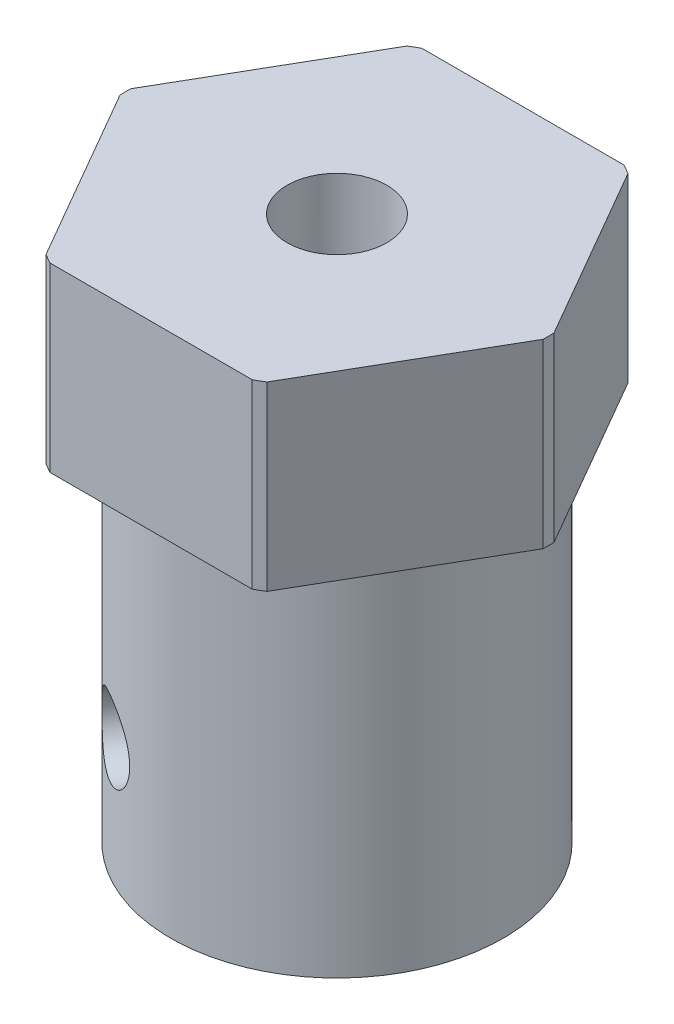
ISO-10303-21;
HEADER;
FILE_DESCRIPTION(('STEP AP214'),'2;1');
FILE_NAME('part.step','',(''),(''),'','','');
FILE_SCHEMA(('AUTOMOTIVE_DESIGN { 1 0 10303 214 1 1 1 1 }'));
ENDSEC;
DATA;
#1=APPLICATION_CONTEXT('core data for automotive mechanical design processes');
#2=APPLICATION_PROTOCOL_DEFINITION('international standard','automotive_design',2000,#1);
#3=PRODUCT_CONTEXT('',#1,'mechanical');
#4=PRODUCT('Part','Part','',(#3));
#5=PRODUCT_RELATED_PRODUCT_CATEGORY('part','',(#4));
#6=PRODUCT_DEFINITION_FORMATION('','',#4);
#7=PRODUCT_DEFINITION_CONTEXT('part definition',#1,'design');
#8=PRODUCT_DEFINITION('design','',#6,#7);
#9=PRODUCT_DEFINITION_SHAPE('','',#8);
#10=(LENGTH_UNIT() NAMED_UNIT(*) SI_UNIT(.MILLI.,.METRE.));
#11=(NAMED_UNIT(*) PLANE_ANGLE_UNIT() SI_UNIT($,.RADIAN.));
#12=(NAMED_UNIT(*) SI_UNIT($,.STERADIAN.) SOLID_ANGLE_UNIT());
#13=UNCERTAINTY_MEASURE_WITH_UNIT(LENGTH_MEASURE(1.E-05),#10,'distance_accuracy_value','');
#14=(GEOMETRIC_REPRESENTATION_CONTEXT(3) GLOBAL_UNCERTAINTY_ASSIGNED_CONTEXT((#13)) GLOBAL_UNIT_ASSIGNED_CONTEXT((#10,
#11,#12)) REPRESENTATION_CONTEXT('',''));
#15=CARTESIAN_POINT('',(0.,0.,0.));
#16=DIRECTION('',(0.,0.,1.));
#17=DIRECTION('',(1.,0.,0.));
#18=AXIS2_PLACEMENT_3D('',#15,#16,#17);
#19=CARTESIAN_POINT('',(0.,18.,0.));
#20=DIRECTION('',(0.,1.,0.));
#21=DIRECTION('',(0.,0.,1.));
#22=AXIS2_PLACEMENT_3D('',#19,#20,#21);
#23=CYLINDRICAL_SURFACE('',#22,1.64999999999999);
#24=CARTESIAN_POINT('',(0.,18.,0.));
#25=DIRECTION('',(0.,1.,0.));
#26=DIRECTION('',(0.,0.,1.));
#27=AXIS2_PLACEMENT_3D('',#24,#25,#26);
#28=CIRCLE('',#27,1.64999999999999);
#29=CARTESIAN_POINT('',(0.,18.,1.64999999999999));
#30=VERTEX_POINT('',#29);
#31=EDGE_CURVE('E185',#30,#30,#28,.T.);
#32=ORIENTED_EDGE('',*,*,#31,.T.);
#33=EDGE_LOOP('',(#32));
#34=FACE_BOUND('',#33,.T.);
#35=CARTESIAN_POINT('',(0.,14.,0.));
#36=DIRECTION('',(0.,-1.,0.));
#37=DIRECTION('',(0.,0.,-1.));
#38=AXIS2_PLACEMENT_3D('',#35,#36,#37);
#39=CIRCLE('',#38,1.64999999999999);
#40=CARTESIAN_POINT('',(0.,14.,-1.64999999999999));
#41=VERTEX_POINT('',#40);
#42=EDGE_CURVE('E183',#41,#41,#39,.F.);
#43=ORIENTED_EDGE('',*,*,#42,.F.);
#44=EDGE_LOOP('',(#43));
#45=FACE_BOUND('',#44,.T.);
#46=ADVANCED_FACE('F38',(#34,#45),#23,.F.);
#47=CARTESIAN_POINT('',(0.,18.,0.));
#48=DIRECTION('',(0.,1.,0.));
#49=DIRECTION('',(0.,0.,1.));
#50=AXIS2_PLACEMENT_3D('',#47,#48,#49);
#51=PLANE('',#50);
#52=ORIENTED_EDGE('',*,*,#31,.F.);
#53=EDGE_LOOP('',(#52));
#54=FACE_BOUND('',#53,.T.);
#55=CARTESIAN_POINT('',(0.,18.,0.));
#56=DIRECTION('',(0.,-1.,0.));
#57=DIRECTION('',(0.,0.,-1.));
#58=AXIS2_PLACEMENT_3D('',#55,#56,#57);
#59=CIRCLE('',#58,7.);
#60=CARTESIAN_POINT('',(3.65441781543388,18.,5.97036267158365));
#61=VERTEX_POINT('',#60);
#62=CARTESIAN_POINT('',(3.34327683568083,18.,6.15));
#63=VERTEX_POINT('',#62);
#64=EDGE_CURVE('E160',#61,#63,#59,.T.);
#65=ORIENTED_EDGE('',*,*,#64,.F.);
#66=DIRECTION('',(0.5,0.,-0.866025403784438));
#67=VECTOR('',#66,1.);
#68=CARTESIAN_POINT('',(3.5507041555162,18.,6.15));
#69=LINE('',#68,#67);
#70=CARTESIAN_POINT('',(6.99769465111471,18.,0.17963732841635));
#71=VERTEX_POINT('',#70);
#72=EDGE_CURVE('E144',#61,#71,#69,.T.);
#73=ORIENTED_EDGE('',*,*,#72,.T.);
#74=CARTESIAN_POINT('',(6.99769465111471,18.,-0.179637328416352));
#75=VERTEX_POINT('',#74);
#76=EDGE_CURVE('E151',#75,#71,#59,.T.);
#77=ORIENTED_EDGE('',*,*,#76,.F.);
#78=DIRECTION('',(-0.5,0.,-0.866025403784438));
#79=VECTOR('',#78,1.);
#80=CARTESIAN_POINT('',(7.1014083110324,18.,0.));
#81=LINE('',#80,#79);
#82=CARTESIAN_POINT('',(3.65441781543388,18.,-5.97036267158365));
#83=VERTEX_POINT('',#82);
#84=EDGE_CURVE('E132',#75,#83,#81,.T.);
#85=ORIENTED_EDGE('',*,*,#84,.T.);
#86=CARTESIAN_POINT('',(3.34327683568083,18.,-6.15));
#87=VERTEX_POINT('',#86);
#88=EDGE_CURVE('E159',#87,#83,#59,.T.);
#89=ORIENTED_EDGE('',*,*,#88,.F.);
#90=DIRECTION('',(-1.,0.,0.));
#91=VECTOR('',#90,1.);
#92=CARTESIAN_POINT('',(3.5507041555162,18.,-6.15));
#93=LINE('',#92,#91);
#94=CARTESIAN_POINT('',(-3.34327683568083,18.,-6.15));
#95=VERTEX_POINT('',#94);
#96=EDGE_CURVE('E143',#87,#95,#93,.T.);
#97=ORIENTED_EDGE('',*,*,#96,.T.);
#98=CARTESIAN_POINT('',(-3.65441781543388,18.,-5.97036267158365));
#99=VERTEX_POINT('',#98);
#100=EDGE_CURVE('E163',#99,#95,#59,.T.);
#101=ORIENTED_EDGE('',*,*,#100,.F.);
#102=DIRECTION('',(-0.5,0.,0.866025403784439));
#103=VECTOR('',#102,1.);
#104=CARTESIAN_POINT('',(-3.5507041555162,18.,-6.15));
#105=LINE('',#104,#103);
#106=CARTESIAN_POINT('',(-6.99769465111471,18.,-0.179637328416349));
#107=VERTEX_POINT('',#106);
#108=EDGE_CURVE('E302',#99,#107,#105,.T.);
#109=ORIENTED_EDGE('',*,*,#108,.T.);
#110=CARTESIAN_POINT('',(-6.99769465111471,18.,0.17963732841635));
#111=VERTEX_POINT('',#110);
#112=EDGE_CURVE('E485',#111,#107,#59,.T.);
#113=ORIENTED_EDGE('',*,*,#112,.F.);
#114=DIRECTION('',(0.5,0.,0.866025403784438));
#115=VECTOR('',#114,1.);
#116=CARTESIAN_POINT('',(-7.1014083110324,18.,0.));
#117=LINE('',#116,#115);
#118=CARTESIAN_POINT('',(-3.65441781543388,18.,5.97036267158365));
#119=VERTEX_POINT('',#118);
#120=EDGE_CURVE('E299',#111,#119,#117,.T.);
#121=ORIENTED_EDGE('',*,*,#120,.T.);
#122=CARTESIAN_POINT('',(-3.34327683568083,18.,6.15));
#123=VERTEX_POINT('',#122);
#124=EDGE_CURVE('E165',#123,#119,#59,.T.);
#125=ORIENTED_EDGE('',*,*,#124,.F.);
#126=DIRECTION('',(1.,0.,0.));
#127=VECTOR('',#126,1.);
#128=CARTESIAN_POINT('',(-3.5507041555162,18.,6.15));
#129=LINE('',#128,#127);
#130=EDGE_CURVE('E296',#123,#63,#129,.T.);
#131=ORIENTED_EDGE('',*,*,#130,.T.);
#132=EDGE_LOOP('',(#65,#73,#77,#85,#89,#97,#101,#109,#113,#121,#125,#131));
#133=FACE_BOUND('',#132,.T.);
#134=ADVANCED_FACE('F158',(#54,#133),#51,.T.);
#135=CARTESIAN_POINT('',(0.,0.,0.));
#136=DIRECTION('',(0.,-1.,0.));
#137=DIRECTION('',(0.,0.,-1.));
#138=AXIS2_PLACEMENT_3D('',#135,#136,#137);
#139=CYLINDRICAL_SURFACE('',#138,7.);
#140=CARTESIAN_POINT('',(0.,12.,0.));
#141=DIRECTION('',(0.,-1.,0.));
#142=DIRECTION('',(0.,0.,-1.));
#143=AXIS2_PLACEMENT_3D('',#140,#141,#142);
#144=CIRCLE('',#143,7.);
#145=CARTESIAN_POINT('',(3.65441781543388,12.,5.97036267158366));
#146=VERTEX_POINT('',#145);
#147=CARTESIAN_POINT('',(3.34327683568083,12.,6.15));
#148=VERTEX_POINT('',#147);
#149=EDGE_CURVE('E258',#146,#148,#144,.T.);
#150=ORIENTED_EDGE('',*,*,#149,.F.);
#151=DIRECTION('',(0.,-1.,0.));
#152=VECTOR('',#151,1.);
#153=CARTESIAN_POINT('',(3.65441781543388,0.,5.97036267158365));
#154=LINE('',#153,#152);
#155=EDGE_CURVE('E250',#146,#61,#154,.F.);
#156=ORIENTED_EDGE('',*,*,#155,.T.);
#157=ORIENTED_EDGE('',*,*,#64,.T.);
#158=DIRECTION('',(0.,-1.,0.));
#159=VECTOR('',#158,1.);
#160=CARTESIAN_POINT('',(3.34327683568083,0.,6.15));
#161=LINE('',#160,#159);
#162=EDGE_CURVE('E279',#63,#148,#161,.T.);
#163=ORIENTED_EDGE('',*,*,#162,.T.);
#164=EDGE_LOOP('',(#150,#156,#157,#163));
#165=FACE_BOUND('',#164,.T.);
#166=ADVANCED_FACE('F386',(#165),#139,.T.);
#167=ORIENTED_EDGE('',*,*,#76,.T.);
#168=DIRECTION('',(0.,-1.,0.));
#169=VECTOR('',#168,1.);
#170=CARTESIAN_POINT('',(6.99769465111471,0.,0.17963732841635));
#171=LINE('',#170,#169);
#172=CARTESIAN_POINT('',(6.99769465111471,12.,0.179637328416346));
#173=VERTEX_POINT('',#172);
#174=EDGE_CURVE('E248',#71,#173,#171,.T.);
#175=ORIENTED_EDGE('',*,*,#174,.T.);
#176=CARTESIAN_POINT('',(6.99769465111471,12.,-0.179637328416353));
#177=VERTEX_POINT('',#176);
#178=EDGE_CURVE('E153',#177,#173,#144,.T.);
#179=ORIENTED_EDGE('',*,*,#178,.F.);
#180=DIRECTION('',(0.,-1.,0.));
#181=VECTOR('',#180,1.);
#182=CARTESIAN_POINT('',(6.99769465111471,0.,-0.179637328416351));
#183=LINE('',#182,#181);
#184=EDGE_CURVE('E135',#177,#75,#183,.F.);
#185=ORIENTED_EDGE('',*,*,#184,.T.);
#186=EDGE_LOOP('',(#167,#175,#179,#185));
#187=FACE_BOUND('',#186,.T.);
#188=ADVANCED_FACE('F149',(#187),#139,.T.);
#189=CARTESIAN_POINT('',(-3.34327683568083,12.,6.15));
#190=VERTEX_POINT('',#189);
#191=CARTESIAN_POINT('',(-3.65441781543388,12.,5.97036267158365));
#192=VERTEX_POINT('',#191);
#193=EDGE_CURVE('E260',#190,#192,#144,.T.);
#194=ORIENTED_EDGE('',*,*,#193,.F.);
#195=DIRECTION('',(0.,-1.,0.));
#196=VECTOR('',#195,1.);
#197=CARTESIAN_POINT('',(-3.34327683568083,0.,6.15));
#198=LINE('',#197,#196);
#199=EDGE_CURVE('E254',#190,#123,#198,.F.);
#200=ORIENTED_EDGE('',*,*,#199,.T.);
#201=ORIENTED_EDGE('',*,*,#124,.T.);
#202=DIRECTION('',(0.,-1.,0.));
#203=VECTOR('',#202,1.);
#204=CARTESIAN_POINT('',(-3.65441781543388,0.,5.97036267158365));
#205=LINE('',#204,#203);
#206=EDGE_CURVE('E283',#119,#192,#205,.T.);
#207=ORIENTED_EDGE('',*,*,#206,.T.);
#208=EDGE_LOOP('',(#194,#200,#201,#207));
#209=FACE_BOUND('',#208,.T.);
#210=ADVANCED_FACE('F457',(#209),#139,.T.);
#211=CARTESIAN_POINT('',(-6.99769465111471,12.,0.179637328416349));
#212=VERTEX_POINT('',#211);
#213=CARTESIAN_POINT('',(-6.99769465111472,12.,-0.179637328416349));
#214=VERTEX_POINT('',#213);
#215=EDGE_CURVE('E262',#212,#214,#144,.T.);
#216=ORIENTED_EDGE('',*,*,#215,.F.);
#217=DIRECTION('',(0.,-1.,0.));
#218=VECTOR('',#217,1.);
#219=CARTESIAN_POINT('',(-6.99769465111471,0.,0.17963732841635));
#220=LINE('',#219,#218);
#221=EDGE_CURVE('E67',#212,#111,#220,.F.);
#222=ORIENTED_EDGE('',*,*,#221,.T.);
#223=ORIENTED_EDGE('',*,*,#112,.T.);
#224=DIRECTION('',(0.,-1.,0.));
#225=VECTOR('',#224,1.);
#226=CARTESIAN_POINT('',(-6.99769465111471,0.,-0.179637328416349));
#227=LINE('',#226,#225);
#228=EDGE_CURVE('E287',#107,#214,#227,.T.);
#229=ORIENTED_EDGE('',*,*,#228,.T.);
#230=EDGE_LOOP('',(#216,#222,#223,#229));
#231=FACE_BOUND('',#230,.T.);
#232=ADVANCED_FACE('F448',(#231),#139,.T.);
#233=CARTESIAN_POINT('',(-3.65441781543388,12.,-5.97036267158365));
#234=VERTEX_POINT('',#233);
#235=CARTESIAN_POINT('',(-3.34327683568083,12.,-6.15));
#236=VERTEX_POINT('',#235);
#237=EDGE_CURVE('E259',#234,#236,#144,.T.);
#238=ORIENTED_EDGE('',*,*,#237,.F.);
#239=DIRECTION('',(0.,-1.,0.));
#240=VECTOR('',#239,1.);
#241=CARTESIAN_POINT('',(-3.65441781543388,0.,-5.97036267158365));
#242=LINE('',#241,#240);
#243=EDGE_CURVE('E59',#234,#99,#242,.F.);
#244=ORIENTED_EDGE('',*,*,#243,.T.);
#245=ORIENTED_EDGE('',*,*,#100,.T.);
#246=DIRECTION('',(0.,-1.,0.));
#247=VECTOR('',#246,1.);
#248=CARTESIAN_POINT('',(-3.34327683568083,0.,-6.15));
#249=LINE('',#248,#247);
#250=EDGE_CURVE('E154',#95,#236,#249,.T.);
#251=ORIENTED_EDGE('',*,*,#250,.T.);
#252=EDGE_LOOP('',(#238,#244,#245,#251));
#253=FACE_BOUND('',#252,.T.);
#254=ADVANCED_FACE('F438',(#253),#139,.T.);
#255=CARTESIAN_POINT('',(3.34327683568083,12.,-6.15));
#256=VERTEX_POINT('',#255);
#257=CARTESIAN_POINT('',(3.65441781543388,12.,-5.97036267158365));
#258=VERTEX_POINT('',#257);
#259=EDGE_CURVE('E168',#256,#258,#144,.T.);
#260=ORIENTED_EDGE('',*,*,#259,.F.);
#261=DIRECTION('',(0.,-1.,0.));
#262=VECTOR('',#261,1.);
#263=CARTESIAN_POINT('',(3.34327683568083,0.,-6.15));
#264=LINE('',#263,#262);
#265=EDGE_CURVE('E290',#256,#87,#264,.F.);
#266=ORIENTED_EDGE('',*,*,#265,.T.);
#267=ORIENTED_EDGE('',*,*,#88,.T.);
#268=DIRECTION('',(0.,-1.,0.));
#269=VECTOR('',#268,1.);
#270=CARTESIAN_POINT('',(3.65441781543388,0.,-5.97036267158365));
#271=LINE('',#270,#269);
#272=EDGE_CURVE('E138',#83,#258,#271,.T.);
#273=ORIENTED_EDGE('',*,*,#272,.T.);
#274=EDGE_LOOP('',(#260,#266,#267,#273));
#275=FACE_BOUND('',#274,.T.);
#276=ADVANCED_FACE('F429',(#275),#139,.T.);
#277=CARTESIAN_POINT('',(7.,12.,0.));
#278=DIRECTION('',(0.,-1.,0.));
#279=DIRECTION('',(0.,0.,-1.));
#280=AXIS2_PLACEMENT_3D('',#277,#278,#279);
#281=PLANE('',#280);
#282=CARTESIAN_POINT('',(0.,12.,0.));
#283=DIRECTION('',(0.,-1.,0.));
#284=DIRECTION('',(0.,0.,-1.));
#285=AXIS2_PLACEMENT_3D('',#282,#283,#284);
#286=CIRCLE('',#285,5.5);
#287=CARTESIAN_POINT('',(0.,12.,-5.5));
#288=VERTEX_POINT('',#287);
#289=EDGE_CURVE('E267',#288,#288,#286,.T.);
#290=ORIENTED_EDGE('',*,*,#289,.F.);
#291=EDGE_LOOP('',(#290));
#292=FACE_BOUND('',#291,.T.);
#293=ORIENTED_EDGE('',*,*,#178,.T.);
#294=DIRECTION('',(-0.5,0.,0.866025403784439));
#295=VECTOR('',#294,1.);
#296=CARTESIAN_POINT('',(7.0760562332743,12.,0.0439110867544634));
#297=LINE('',#296,#295);
#298=EDGE_CURVE('E52',#173,#146,#297,.T.);
#299=ORIENTED_EDGE('',*,*,#298,.T.);
#300=ORIENTED_EDGE('',*,*,#149,.T.);
#301=DIRECTION('',(-1.,0.,0.));
#302=VECTOR('',#301,1.);
#303=CARTESIAN_POINT('',(7.,12.,6.15));
#304=LINE('',#303,#302);
#305=EDGE_CURVE('E178',#148,#190,#304,.T.);
#306=ORIENTED_EDGE('',*,*,#305,.T.);
#307=ORIENTED_EDGE('',*,*,#193,.T.);
#308=DIRECTION('',(-0.5,0.,-0.866025403784439));
#309=VECTOR('',#308,1.);
#310=CARTESIAN_POINT('',(-3.57605623327429,12.,6.10608891324554));
#311=LINE('',#310,#309);
#312=EDGE_CURVE('E176',#192,#212,#311,.T.);
#313=ORIENTED_EDGE('',*,*,#312,.T.);
#314=ORIENTED_EDGE('',*,*,#215,.T.);
#315=DIRECTION('',(0.5,0.,-0.866025403784439));
#316=VECTOR('',#315,1.);
#317=CARTESIAN_POINT('',(-3.5760562332743,12.,-6.10608891324554));
#318=LINE('',#317,#316);
#319=EDGE_CURVE('E174',#214,#234,#318,.T.);
#320=ORIENTED_EDGE('',*,*,#319,.T.);
#321=ORIENTED_EDGE('',*,*,#237,.T.);
#322=DIRECTION('',(1.,0.,0.));
#323=VECTOR('',#322,1.);
#324=CARTESIAN_POINT('',(7.,12.,-6.15));
#325=LINE('',#324,#323);
#326=EDGE_CURVE('E171',#236,#256,#325,.T.);
#327=ORIENTED_EDGE('',*,*,#326,.T.);
#328=ORIENTED_EDGE('',*,*,#259,.T.);
#329=DIRECTION('',(0.5,0.,0.866025403784439));
#330=VECTOR('',#329,1.);
#331=CARTESIAN_POINT('',(7.0760562332743,12.,-0.0439110867544645));
#332=LINE('',#331,#330);
#333=EDGE_CURVE('E162',#258,#177,#332,.T.);
#334=ORIENTED_EDGE('',*,*,#333,.T.);
#335=EDGE_LOOP('',(#293,#299,#300,#306,#307,#313,#314,#320,#321,#327,#328,#334));
#336=FACE_BOUND('',#335,.T.);
#337=ADVANCED_FACE('F256',(#292,#336),#281,.T.);
#338=CARTESIAN_POINT('',(5.5,0.,0.));
#339=DIRECTION('',(0.,-1.,0.));
#340=DIRECTION('',(0.,0.,-1.));
#341=AXIS2_PLACEMENT_3D('',#338,#339,#340);
#342=PLANE('',#341);
#343=CARTESIAN_POINT('',(0.,0.,0.));
#344=DIRECTION('',(0.,-1.,0.));
#345=DIRECTION('',(0.,0.,-1.));
#346=AXIS2_PLACEMENT_3D('',#343,#344,#345);
#347=CIRCLE('',#346,3.);
#348=CARTESIAN_POINT('',(0.,0.,-3.));
#349=VERTEX_POINT('',#348);
#350=EDGE_CURVE('E310',#349,#349,#347,.T.);
#351=ORIENTED_EDGE('',*,*,#350,.F.);
#352=EDGE_LOOP('',(#351));
#353=FACE_BOUND('',#352,.T.);
#354=CARTESIAN_POINT('',(0.,0.,0.));
#355=DIRECTION('',(0.,-1.,0.));
#356=DIRECTION('',(0.,0.,-1.));
#357=AXIS2_PLACEMENT_3D('',#354,#355,#356);
#358=CIRCLE('',#357,5.5);
#359=CARTESIAN_POINT('',(0.,0.,-5.5));
#360=VERTEX_POINT('',#359);
#361=EDGE_CURVE('E270',#360,#360,#358,.T.);
#362=ORIENTED_EDGE('',*,*,#361,.T.);
#363=EDGE_LOOP('',(#362));
#364=FACE_BOUND('',#363,.T.);
#365=ADVANCED_FACE('F40',(#353,#364),#342,.T.);
#366=CARTESIAN_POINT('',(0.,0.,0.));
#367=DIRECTION('',(0.,-1.,0.));
#368=DIRECTION('',(0.,0.,-1.));
#369=AXIS2_PLACEMENT_3D('',#366,#367,#368);
#370=CYLINDRICAL_SURFACE('',#369,5.5);
#371=CARTESIAN_POINT('',(3.76056741543411,4.,-4.01349382881987));
#372=CARTESIAN_POINT('',(3.76056613474576,3.93076690452368,-4.01349617821411));
#373=CARTESIAN_POINT('',(3.75624770433558,3.86150695883166,-4.01755474638396));
#374=CARTESIAN_POINT('',(3.73905172121981,3.72496171247158,-4.03356235091277));
#375=CARTESIAN_POINT('',(3.72616829804125,3.65767779923269,-4.04551679909626));
#376=CARTESIAN_POINT('',(3.6921046380708,3.52707947081334,-4.07662741622723));
#377=CARTESIAN_POINT('',(3.67093392033627,3.46376059770754,-4.09577532152167));
#378=CARTESIAN_POINT('',(3.62067366235667,3.34270080015933,-4.14027099092383));
#379=CARTESIAN_POINT('',(3.59158415263035,3.28495985422092,-4.16561873113756));
#380=CARTESIAN_POINT('',(3.52543801396755,3.17564225956455,-4.22175247876766));
#381=CARTESIAN_POINT('',(3.48825865745847,3.12418210979473,-4.25262078445783));
#382=CARTESIAN_POINT('',(3.40687724505463,3.02990874744541,-4.31809102301055));
#383=CARTESIAN_POINT('',(3.36267461635177,2.98709624080283,-4.35269326033335));
#384=CARTESIAN_POINT('',(3.26754380138668,2.91086847586397,-4.42456166711413));
#385=CARTESIAN_POINT('',(3.21654469403445,2.87756589978466,-4.46185370662492));
#386=CARTESIAN_POINT('',(3.10934860610087,2.82203329079346,-4.53720590857373));
#387=CARTESIAN_POINT('',(3.05315225716619,2.79980191443482,-4.57526597723092));
#388=CARTESIAN_POINT('',(2.93796677412166,2.7674109521256,-4.65005212983055));
#389=CARTESIAN_POINT('',(2.87904076033177,2.75705401132126,-4.68678988645256));
#390=CARTESIAN_POINT('',(2.7591687853517,2.7480882334594,-4.75834606384621));
#391=CARTESIAN_POINT('',(2.69822307379663,2.74947794986704,-4.79316472041273));
#392=CARTESIAN_POINT('',(2.5772510760968,2.76382036428674,-4.85926367857326));
#393=CARTESIAN_POINT('',(2.51722845726964,2.77656026400688,-4.89059721387377));
#394=CARTESIAN_POINT('',(2.39877545508293,2.81290153982572,-4.94977399531115));
#395=CARTESIAN_POINT('',(2.34034514750189,2.83650343189668,-4.97761707556258));
#396=CARTESIAN_POINT('',(2.22640680641598,2.89408270493356,-5.02961915078648));
#397=CARTESIAN_POINT('',(2.17092507236776,2.92813945036789,-5.05374776875917));
#398=CARTESIAN_POINT('',(2.0650928964493,3.00560225597795,-5.09790981856592));
#399=CARTESIAN_POINT('',(2.01474320678409,3.04900968379099,-5.11794265051118));
#400=CARTESIAN_POINT('',(1.91972193650108,3.14509570783165,-5.15434947469793));
#401=CARTESIAN_POINT('',(1.87520314190587,3.1979605054002,-5.17063126607854));
#402=CARTESIAN_POINT('',(1.79476355416625,3.31085540786871,-5.19910086412016));
#403=CARTESIAN_POINT('',(1.75884303326504,3.37088573955754,-5.21128854115603));
#404=CARTESIAN_POINT('',(1.69685237493495,3.49671199405487,-5.23180340010959));
#405=CARTESIAN_POINT('',(1.67081624023166,3.56252687695989,-5.24011727788253));
#406=CARTESIAN_POINT('',(1.62985576278418,3.69787427686965,-5.25300257944505));
#407=CARTESIAN_POINT('',(1.61492950083532,3.76740614954765,-5.25757464963678));
#408=CARTESIAN_POINT('',(1.59704615611508,3.90657712383093,-5.26303428635764));
#409=CARTESIAN_POINT('',(1.59383334549788,3.97618031640686,-5.26400058522075));
#410=CARTESIAN_POINT('',(1.59880669952723,4.11493660407264,-5.26249216222083));
#411=CARTESIAN_POINT('',(1.60699201327373,4.18408973237379,-5.26001769721992));
#412=CARTESIAN_POINT('',(1.63422225277282,4.31905914690419,-5.25162014927935));
#413=CARTESIAN_POINT('',(1.65312492063016,4.38490708340291,-5.24574222125607));
#414=CARTESIAN_POINT('',(1.70091732373301,4.51243279621537,-5.23044031954409));
#415=CARTESIAN_POINT('',(1.72980807663488,4.57411014683461,-5.22101598451384));
#416=CARTESIAN_POINT('',(1.79704769517074,4.69266651951967,-5.19825887261026));
#417=CARTESIAN_POINT('',(1.83554488852175,4.74944946952044,-5.18486411538578));
#418=CARTESIAN_POINT('',(1.92037667702199,4.85558665162301,-5.15404555602852));
#419=CARTESIAN_POINT('',(1.96671232694669,4.90493988225934,-5.13662121154165));
#420=CARTESIAN_POINT('',(2.06669040817764,4.99584054900791,-5.09722768859722));
#421=CARTESIAN_POINT('',(2.12046192172493,5.03720946236039,-5.07517353716997));
#422=CARTESIAN_POINT('',(2.23278045675168,5.10968540715252,-5.02677086952775));
#423=CARTESIAN_POINT('',(2.29132724621913,5.14079293678278,-5.00042256188707));
#424=CARTESIAN_POINT('',(2.41088590375612,5.19162020553998,-4.94388192587312));
#425=CARTESIAN_POINT('',(2.4718785336063,5.21141516369945,-4.91371665661587));
#426=CARTESIAN_POINT('',(2.5947408606343,5.23928827367715,-4.84995928617609));
#427=CARTESIAN_POINT('',(2.65661041801324,5.24736827233215,-4.81636772603446));
#428=CARTESIAN_POINT('',(2.77792261097139,5.25149355808595,-4.74741045896829));
#429=CARTESIAN_POINT('',(2.83738856087226,5.24780453925296,-4.71210139580674));
#430=CARTESIAN_POINT('',(2.95364433987796,5.22909452566095,-4.64011427442751));
#431=CARTESIAN_POINT('',(3.01043422471533,5.21407376701106,-4.60343624474887));
#432=CARTESIAN_POINT('',(3.11967565431959,5.17325818039427,-4.53011470219839));
#433=CARTESIAN_POINT('',(3.172142601325,5.14750377744901,-4.49347157150855));
#434=CARTESIAN_POINT('',(3.27180278077306,5.08599038657019,-4.42143548996492));
#435=CARTESIAN_POINT('',(3.31899545769121,5.05023034615724,-4.38604267107106));
#436=CARTESIAN_POINT('',(3.40807599957962,4.96886901767744,-4.31720448448482));
#437=CARTESIAN_POINT('',(3.44983660368654,4.9230825427971,-4.28381329392804));
#438=CARTESIAN_POINT('',(3.52614549248053,4.82333801485541,-4.22122484807026));
#439=CARTESIAN_POINT('',(3.56069201671138,4.76937797272355,-4.1920286170087));
#440=CARTESIAN_POINT('',(3.6224147566001,4.65386400307735,-4.13881633246429));
#441=CARTESIAN_POINT('',(3.64947521638396,4.59221014351547,-4.11488269857081));
#442=CARTESIAN_POINT('',(3.69503294691157,4.46367557431419,-4.07402442382527));
#443=CARTESIAN_POINT('',(3.71353720663947,4.39679918299464,-4.05709406366596));
#444=CARTESIAN_POINT('',(3.73854188151719,4.27491602127444,-4.03404538039895));
#445=CARTESIAN_POINT('',(3.74679128011852,4.22055191371569,-4.02636457954888));
#446=CARTESIAN_POINT('',(3.75780440346297,4.11079756409271,-4.01608800833018));
#447=CARTESIAN_POINT('',(3.76056844037149,4.05540738060232,-4.0134919485951));
#448=CARTESIAN_POINT('',(3.76056741543411,4.,-4.01349382881987));
#449=B_SPLINE_CURVE_WITH_KNOTS('',3,(#371,#372,#373,#374,#375,#376,#377,#378,#379,#380,#381,
#382,#383,#384,#385,#386,#387,#388,#389,#390,#391,#392,#393,#394,#395,#396,#397,#398,#399,#400,
#401,#402,#403,#404,#405,#406,#407,#408,#409,#410,#411,#412,#413,#414,#415,#416,#417,#418,#419,
#420,#421,#422,#423,#424,#425,#426,#427,#428,#429,#430,#431,#432,#433,#434,#435,#436,#437,#438,
#439,#440,#441,#442,#443,#444,#445,#446,#447,#448),.UNSPECIFIED.,.T.,.F.,(4,2,2,2,2,2,2,2,2,2,2,
2,2,2,2,2,2,2,2,2,2,2,2,2,2,2,2,2,2,2,2,2,2,2,2,2,2,2,4),(0.,0.207496121650815,
0.415134608622389,0.6225352917884,0.829935175650531,1.04073318636022,1.2515483982898,
1.46476669375054,1.67795910969756,1.88755439091892,2.0971238620348,2.3028450333366,
2.50857597792603,2.71590898418403,2.92327233572578,3.13528932547436,3.34731302733211,
3.5600596298443,3.77276947234059,3.98080665115181,4.18882830027155,4.39415131138951,
4.59949524842833,4.80823060479209,5.01699407183282,5.2299896299062,5.44297484551385,
5.65452690065784,5.86604560147263,6.07282318924714,6.27959646870455,6.48559793754365,
6.69162108354879,6.90183008119014,7.11209031646659,7.32544005280888,7.53861520890219,
7.70468420860327,7.8707437572442),.UNSPECIFIED.);
#450=CARTESIAN_POINT('',(3.76056741543411,4.,-4.01349382881987));
#451=VERTEX_POINT('',#450);
#452=EDGE_CURVE('E42',#451,#451,#449,.T.);
#453=ORIENTED_EDGE('',*,*,#452,.F.);
#454=EDGE_LOOP('',(#453));
#455=FACE_BOUND('',#454,.T.);
#456=CARTESIAN_POINT('',(-1.59550390597302,4.,5.26349382881987));
#457=CARTESIAN_POINT('',(-1.5955065809523,4.06923309547632,5.26349389440834));
#458=CARTESIAN_POINT('',(-1.60118061929547,4.13849304116834,5.26178330805357));
#459=CARTESIAN_POINT('',(-1.62364160302903,4.27503828752842,5.25489495209668));
#460=CARTESIAN_POINT('',(-1.64043617043344,4.34232220076731,5.24971480442808));
#461=CARTESIAN_POINT('',(-1.68441058518151,4.47292052918666,5.23577011811327));
#462=CARTESIAN_POINT('',(-1.71157851646301,4.53623940229246,5.22700969138605));
#463=CARTESIAN_POINT('',(-1.77524302551348,4.65729919984067,5.20573086587603));
#464=CARTESIAN_POINT('',(-1.81173956733026,4.71504014577908,5.19321248157627));
#465=CARTESIAN_POINT('',(-1.89342588811894,4.82435774043545,5.16399511894708));
#466=CARTESIAN_POINT('',(-1.93874830327296,4.87581789020527,5.14723100455895));
#467=CARTESIAN_POINT('',(-2.03613789925336,4.9700912525546,5.10948775329773));
#468=CARTESIAN_POINT('',(-2.08820563015411,5.01290375919717,5.0885082725884));
#469=CARTESIAN_POINT('',(-2.19801090363832,5.08913152413603,5.0420567735363));
#470=CARTESIAN_POINT('',(-2.25580631088972,5.12243410021534,5.01653627075434));
#471=CARTESIAN_POINT('',(-2.37466127597528,5.17796670920654,4.96137783639195));
#472=CARTESIAN_POINT('',(-2.43572043676952,5.20019808556518,4.93174040494318));
#473=CARTESIAN_POINT('',(-2.55807988629436,5.2325890478744,4.86937992677924));
#474=CARTESIAN_POINT('',(-2.61935872370202,5.24294598867874,4.83671738020446));
#475=CARTESIAN_POINT('',(-2.74126417861266,5.2519117665406,4.76868329336673));
#476=CARTESIAN_POINT('',(-2.80189087550245,5.25052205013296,4.73331208719158));
#477=CARTESIAN_POINT('',(-2.91962025128307,5.23617963571326,4.66159674311724));
#478=CARTESIAN_POINT('',(-2.97676719825726,5.22343973599312,4.6252823980615));
#479=CARTESIAN_POINT('',(-3.08724229538959,5.18709846017428,4.55228747973197));
#480=CARTESIAN_POINT('',(-3.14057026399745,5.16349656810332,4.51560688914156));
#481=CARTESIAN_POINT('',(-3.24257455273382,5.10591729506644,4.44293442890806));
#482=CARTESIAN_POINT('',(-3.29121141588049,5.07186054963211,4.40695014676263));
#483=CARTESIAN_POINT('',(-3.38237296085556,4.99439774402205,4.33737781878284));
#484=CARTESIAN_POINT('',(-3.4248967470625,4.95099031620901,4.30379012443274));
#485=CARTESIAN_POINT('',(-3.50393661682084,4.85490429216835,4.23970270256115));
#486=CARTESIAN_POINT('',(-3.54029645907318,4.8020394945998,4.20928919118615));
#487=CARTESIAN_POINT('',(-3.60517164808256,4.68914459213129,4.1538612637545));
#488=CARTESIAN_POINT('',(-3.63368674645935,4.62911426044246,4.12884701865482));
#489=CARTESIAN_POINT('',(-3.68244846463323,4.50328800594513,4.08541896322042));
#490=CARTESIAN_POINT('',(-3.70266656134021,4.43747312304011,4.06702794803748));
#491=CARTESIAN_POINT('',(-3.73430579855251,4.30212572313035,4.03799778479809));
#492=CARTESIAN_POINT('',(-3.74572845846086,4.23259385045235,4.0273572978627));
#493=CARTESIAN_POINT('',(-3.75939831491668,4.09342287616907,4.01459968539076));
#494=CARTESIAN_POINT('',(-3.76184155958838,4.02381968359314,4.01230045921028));
#495=CARTESIAN_POINT('',(-3.75804854993612,3.88506339592736,4.01585329864175));
#496=CARTESIAN_POINT('',(-3.75181294351131,3.81591026762621,4.02170475578371));
#497=CARTESIAN_POINT('',(-3.73092533391574,3.68094085309581,4.04108806097077));
#498=CARTESIAN_POINT('',(-3.71638356499729,3.61509291659709,4.05451928752289));
#499=CARTESIAN_POINT('',(-3.67923552783708,3.48756720378463,4.08825777186188));
#500=CARTESIAN_POINT('',(-3.65662843783617,3.42588985316539,4.10856573029423));
#501=CARTESIAN_POINT('',(-3.60330039154297,3.30733348048033,4.15541839213527));
#502=CARTESIAN_POINT('',(-3.57245159483355,3.25055053047956,4.1820605609394));
#503=CARTESIAN_POINT('',(-3.50334604527199,3.14441334837699,4.24011776515045));
#504=CARTESIAN_POINT('',(-3.46508829533973,3.09506011774066,4.27153344284266));
#505=CARTESIAN_POINT('',(-3.38098346310981,3.00415945099209,4.33842023953807));
#506=CARTESIAN_POINT('',(-3.33499825094126,2.96279053763961,4.37396066055634));
#507=CARTESIAN_POINT('',(-3.23692104363879,2.89031459284748,4.44703003138426));
#508=CARTESIAN_POINT('',(-3.1848293451415,2.85920706321722,4.48455888455274));
#509=CARTESIAN_POINT('',(-3.0760843892388,2.80837979446002,4.55982940121517));
#510=CARTESIAN_POINT('',(-3.01946418482493,2.78858483630055,4.59756793348041));
#511=CARTESIAN_POINT('',(-2.90281751883158,2.76071172632285,4.67209114463485));
#512=CARTESIAN_POINT('',(-2.84279159570671,2.75263172766785,4.7088759729751));
#513=CARTESIAN_POINT('',(-2.72241675417279,2.74850644191405,4.77945678033257));
#514=CARTESIAN_POINT('',(-2.66210523354062,2.75219546074704,4.81330127202611));
#515=CARTESIAN_POINT('',(-2.54163466817804,2.77090547433905,4.87798816929218));
#516=CARTESIAN_POINT('',(-2.4814756202969,2.78592623298894,4.90883063740002));
#517=CARTESIAN_POINT('',(-2.36335658700138,2.82674181960573,4.9667757193078));
#518=CARTESIAN_POINT('',(-2.30538923144709,2.85249622255099,4.99389186292858));
#519=CARTESIAN_POINT('',(-2.19317406511719,2.91400961342981,5.0441820693045));
#520=CARTESIAN_POINT('',(-2.13892664638449,2.94976965384276,5.06735571694128));
#521=CARTESIAN_POINT('',(-2.03477075710615,3.03113098232256,5.11008263590641));
#522=CARTESIAN_POINT('',(-1.98497283576791,3.0769174572029,5.12955278466199));
#523=CARTESIAN_POINT('',(-1.89261520727469,3.17666198514459,5.16434399796326));
#524=CARTESIAN_POINT('',(-1.85005726736519,3.23062202727645,5.17966405002885));
#525=CARTESIAN_POINT('',(-1.77311270721196,3.34613599692265,5.20651136849145));
#526=CARTESIAN_POINT('',(-1.73885534236341,3.40778985648453,5.21797959715563));
#527=CARTESIAN_POINT('',(-1.68069217321516,3.53632442568581,5.23700461175853));
#528=CARTESIAN_POINT('',(-1.65677792135803,3.60320081700536,5.24456459068147));
#529=CARTESIAN_POINT('',(-1.62431483868616,3.72508397872556,5.25469493270543));
#530=CARTESIAN_POINT('',(-1.61353837072792,3.77944808628431,5.2579987210351));
#531=CARTESIAN_POINT('',(-1.59913203731651,3.88920243590729,5.26239808001705));
#532=CARTESIAN_POINT('',(-1.59550176518192,3.94459261939768,5.26349377632928));
#533=CARTESIAN_POINT('',(-1.59550390597302,4.,5.26349382881987));
#534=B_SPLINE_CURVE_WITH_KNOTS('',3,(#456,#457,#458,#459,#460,#461,#462,#463,#464,#465,#466,
#467,#468,#469,#470,#471,#472,#473,#474,#475,#476,#477,#478,#479,#480,#481,#482,#483,#484,#485,
#486,#487,#488,#489,#490,#491,#492,#493,#494,#495,#496,#497,#498,#499,#500,#501,#502,#503,#504,
#505,#506,#507,#508,#509,#510,#511,#512,#513,#514,#515,#516,#517,#518,#519,#520,#521,#522,#523,
#524,#525,#526,#527,#528,#529,#530,#531,#532,#533),.UNSPECIFIED.,.T.,.F.,(4,2,2,2,2,2,2,2,2,2,2,
2,2,2,2,2,2,2,2,2,2,2,2,2,2,2,2,2,2,2,2,2,2,2,2,2,2,2,4),(0.,0.207496121650815,
0.415134608622389,0.622535291788399,0.829935175650531,1.04073318636022,1.2515483982898,
1.46476669375054,1.67795910969756,1.88755439091892,2.0971238620348,2.3028450333366,
2.50857597792603,2.71590898418403,2.92327233572579,3.13528932547436,3.34731302733211,
3.5600596298443,3.77276947234059,3.98080665115181,4.18882830027155,4.39415131138951,
4.59949524842833,4.80823060479209,5.01699407183282,5.2299896299062,5.44297484551385,
5.65452690065784,5.86604560147263,6.07282318924714,6.27959646870455,6.48559793754365,
6.69162108354879,6.90183008119014,7.11209031646659,7.32544005280887,7.53861520890219,
7.70468420860327,7.8707437572442),.UNSPECIFIED.);
#535=CARTESIAN_POINT('',(-1.59550390597302,4.,5.26349382881987));
#536=VERTEX_POINT('',#535);
#537=EDGE_CURVE('E12',#536,#536,#534,.T.);
#538=ORIENTED_EDGE('',*,*,#537,.F.);
#539=EDGE_LOOP('',(#538));
#540=FACE_BOUND('',#539,.T.);
#541=ORIENTED_EDGE('',*,*,#289,.T.);
#542=EDGE_LOOP('',(#541));
#543=FACE_BOUND('',#542,.T.);
#544=ORIENTED_EDGE('',*,*,#361,.F.);
#545=EDGE_LOOP('',(#544));
#546=FACE_BOUND('',#545,.T.);
#547=ADVANCED_FACE('F190',(#455,#540,#543,#546),#370,.T.);
#548=CARTESIAN_POINT('',(7.1014083110324,0.,0.));
#549=DIRECTION('',(0.866025403784438,0.,-0.5));
#550=DIRECTION('',(-0.5,0.,-0.866025403784439));
#551=AXIS2_PLACEMENT_3D('',#548,#549,#550);
#552=PLANE('',#551);
#553=ORIENTED_EDGE('',*,*,#333,.F.);
#554=ORIENTED_EDGE('',*,*,#272,.F.);
#555=ORIENTED_EDGE('',*,*,#84,.F.);
#556=ORIENTED_EDGE('',*,*,#184,.F.);
#557=EDGE_LOOP('',(#553,#554,#555,#556));
#558=FACE_BOUND('',#557,.T.);
#559=ADVANCED_FACE('F134',(#558),#552,.T.);
#560=CARTESIAN_POINT('',(3.5507041555162,0.,-6.15));
#561=DIRECTION('',(0.,0.,-1.));
#562=DIRECTION('',(-1.,0.,0.));
#563=AXIS2_PLACEMENT_3D('',#560,#561,#562);
#564=PLANE('',#563);
#565=ORIENTED_EDGE('',*,*,#326,.F.);
#566=ORIENTED_EDGE('',*,*,#250,.F.);
#567=ORIENTED_EDGE('',*,*,#96,.F.);
#568=ORIENTED_EDGE('',*,*,#265,.F.);
#569=EDGE_LOOP('',(#565,#566,#567,#568));
#570=FACE_BOUND('',#569,.T.);
#571=ADVANCED_FACE('F237',(#570),#564,.T.);
#572=CARTESIAN_POINT('',(-3.5507041555162,0.,-6.15));
#573=DIRECTION('',(-0.866025403784439,0.,-0.5));
#574=DIRECTION('',(-0.5,0.,0.866025403784439));
#575=AXIS2_PLACEMENT_3D('',#572,#573,#574);
#576=PLANE('',#575);
#577=ORIENTED_EDGE('',*,*,#319,.F.);
#578=ORIENTED_EDGE('',*,*,#228,.F.);
#579=ORIENTED_EDGE('',*,*,#108,.F.);
#580=ORIENTED_EDGE('',*,*,#243,.F.);
#581=EDGE_LOOP('',(#577,#578,#579,#580));
#582=FACE_BOUND('',#581,.T.);
#583=ADVANCED_FACE('F234',(#582),#576,.T.);
#584=CARTESIAN_POINT('',(-7.1014083110324,0.,0.));
#585=DIRECTION('',(-0.866025403784439,0.,0.5));
#586=DIRECTION('',(0.5,0.,0.866025403784439));
#587=AXIS2_PLACEMENT_3D('',#584,#585,#586);
#588=PLANE('',#587);
#589=ORIENTED_EDGE('',*,*,#312,.F.);
#590=ORIENTED_EDGE('',*,*,#206,.F.);
#591=ORIENTED_EDGE('',*,*,#120,.F.);
#592=ORIENTED_EDGE('',*,*,#221,.F.);
#593=EDGE_LOOP('',(#589,#590,#591,#592));
#594=FACE_BOUND('',#593,.T.);
#595=ADVANCED_FACE('F230',(#594),#588,.T.);
#596=CARTESIAN_POINT('',(-3.5507041555162,0.,6.15));
#597=DIRECTION('',(0.,0.,1.));
#598=DIRECTION('',(1.,0.,0.));
#599=AXIS2_PLACEMENT_3D('',#596,#597,#598);
#600=PLANE('',#599);
#601=ORIENTED_EDGE('',*,*,#305,.F.);
#602=ORIENTED_EDGE('',*,*,#162,.F.);
#603=ORIENTED_EDGE('',*,*,#130,.F.);
#604=ORIENTED_EDGE('',*,*,#199,.F.);
#605=EDGE_LOOP('',(#601,#602,#603,#604));
#606=FACE_BOUND('',#605,.T.);
#607=ADVANCED_FACE('F226',(#606),#600,.T.);
#608=CARTESIAN_POINT('',(3.5507041555162,0.,6.15));
#609=DIRECTION('',(0.866025403784439,0.,0.5));
#610=DIRECTION('',(0.5,0.,-0.866025403784439));
#611=AXIS2_PLACEMENT_3D('',#608,#609,#610);
#612=PLANE('',#611);
#613=ORIENTED_EDGE('',*,*,#298,.F.);
#614=ORIENTED_EDGE('',*,*,#174,.F.);
#615=ORIENTED_EDGE('',*,*,#72,.F.);
#616=ORIENTED_EDGE('',*,*,#155,.F.);
#617=EDGE_LOOP('',(#613,#614,#615,#616));
#618=FACE_BOUND('',#617,.T.);
#619=ADVANCED_FACE('F229',(#618),#612,.T.);
#620=CARTESIAN_POINT('',(0.,14.,0.));
#621=DIRECTION('',(0.,-1.,0.));
#622=DIRECTION('',(0.,0.,-1.));
#623=AXIS2_PLACEMENT_3D('',#620,#621,#622);
#624=PLANE('',#623);
#625=CARTESIAN_POINT('',(0.,14.,0.));
#626=DIRECTION('',(0.,-1.,0.));
#627=DIRECTION('',(0.,0.,-1.));
#628=AXIS2_PLACEMENT_3D('',#625,#626,#627);
#629=CIRCLE('',#628,3.);
#630=CARTESIAN_POINT('',(0.,14.,-3.));
#631=VERTEX_POINT('',#630);
#632=EDGE_CURVE('E186',#631,#631,#629,.T.);
#633=ORIENTED_EDGE('',*,*,#632,.T.);
#634=EDGE_LOOP('',(#633));
#635=FACE_BOUND('',#634,.T.);
#636=ORIENTED_EDGE('',*,*,#42,.T.);
#637=EDGE_LOOP('',(#636));
#638=FACE_BOUND('',#637,.T.);
#639=ADVANCED_FACE('F200',(#635,#638),#624,.T.);
#640=CARTESIAN_POINT('',(0.,14.,0.));
#641=DIRECTION('',(0.,-1.,0.));
#642=DIRECTION('',(0.,0.,-1.));
#643=AXIS2_PLACEMENT_3D('',#640,#641,#642);
#644=CYLINDRICAL_SURFACE('',#643,3.);
#645=CARTESIAN_POINT('',(2.44612076906001,4.,-1.7368054534614));
#646=CARTESIAN_POINT('',(2.44611793587489,3.93332810910315,-1.73681536490948));
#647=CARTESIAN_POINT('',(2.44271226164983,3.86654734317378,-1.74163766781894));
#648=CARTESIAN_POINT('',(2.42911186685056,3.73491305794286,-1.76055159169796));
#649=CARTESIAN_POINT('',(2.41889870969531,3.67006527332476,-1.77466838348955));
#650=CARTESIAN_POINT('',(2.39183350585561,3.54443887030893,-1.81097738699851));
#651=CARTESIAN_POINT('',(2.37500851261855,3.48364483628498,-1.83313666363537));
#652=CARTESIAN_POINT('',(2.33483370203182,3.36724055042195,-1.88403784405399));
#653=CARTESIAN_POINT('',(2.31148542804944,3.31162907656688,-1.9127781905061));
#654=CARTESIAN_POINT('',(2.25683673488913,3.20367427502653,-1.9770081238635));
#655=CARTESIAN_POINT('',(2.22516193273983,3.15169244125591,-2.01278704620474));
#656=CARTESIAN_POINT('',(2.15471313051823,3.05579977750244,-2.08802926630227));
#657=CARTESIAN_POINT('',(2.11593640471832,3.01189205938699,-2.12749397580875));
#658=CARTESIAN_POINT('',(2.02968737134211,2.93155046912072,-2.20999486305077));
#659=CARTESIAN_POINT('',(1.98191085210273,2.89552337196765,-2.25311170454675));
#660=CARTESIAN_POINT('',(1.87953656962006,2.8347239794944,-2.33918878854097));
#661=CARTESIAN_POINT('',(1.82494184816355,2.80994668803578,-2.38214909213367));
#662=CARTESIAN_POINT('',(1.71312552037428,2.77366054124326,-2.46368344498079));
#663=CARTESIAN_POINT('',(1.65618846247716,2.76152830509796,-2.50236941152767));
#664=CARTESIAN_POINT('',(1.538840845732,2.74886235884015,-2.57619216884008));
#665=CARTESIAN_POINT('',(1.47843170578438,2.74832394411704,-2.6113303934683));
#666=CARTESIAN_POINT('',(1.35984103874646,2.75853428093332,-2.67489932955124));
#667=CARTESIAN_POINT('',(1.30174768603973,2.76859810052573,-2.70360810807066));
#668=CARTESIAN_POINT('',(1.18598587877274,2.79855310263816,-2.75635358695653));
#669=CARTESIAN_POINT('',(1.12831745585406,2.81844500963017,-2.78038994271591));
#670=CARTESIAN_POINT('',(1.01425509538729,2.86772804089464,-2.82401759320145));
#671=CARTESIAN_POINT('',(0.957894025980086,2.89725946287083,-2.84353547541402));
#672=CARTESIAN_POINT('',(0.848996302540802,2.96484575670034,-2.87792826600272));
#673=CARTESIAN_POINT('',(0.796461008819694,3.00290364084499,-2.89280152903722));
#674=CARTESIAN_POINT('',(0.693197433834961,3.08958242040462,-2.91933499849437));
#675=CARTESIAN_POINT('',(0.642857554768072,3.13875879127901,-2.93069482152027));
#676=CARTESIAN_POINT('',(0.55002233414355,3.24471144070658,-2.94952945788959));
#677=CARTESIAN_POINT('',(0.507530020566693,3.30149063829209,-2.95700277363662));
#678=CARTESIAN_POINT('',(0.430905789057041,3.42339503666191,-2.96915450492362));
#679=CARTESIAN_POINT('',(0.397094542896732,3.48873320574328,-2.97373299081628));
#680=CARTESIAN_POINT('',(0.341612775565265,3.6244810449745,-2.98061932496149));
#681=CARTESIAN_POINT('',(0.319933573902216,3.69488704826955,-2.98292879759199));
#682=CARTESIAN_POINT('',(0.291141523620565,3.833896808914,-2.98587241446625));
#683=CARTESIAN_POINT('',(0.283174857661621,3.90232112225905,-2.98660553355333));
#684=CARTESIAN_POINT('',(0.27968168711323,4.0394784824115,-2.98693550240666));
#685=CARTESIAN_POINT('',(0.284150878695406,4.10821141419171,-2.98653274527876));
#686=CARTESIAN_POINT('',(0.304523331578417,4.23939838543045,-2.98451943369508));
#687=CARTESIAN_POINT('',(0.319676234508858,4.3019726867868,-2.98298785650261));
#688=CARTESIAN_POINT('',(0.359735507031347,4.42385129649787,-2.97842134674935));
#689=CARTESIAN_POINT('',(0.384644156383222,4.48315483683071,-2.9753860627527));
#690=CARTESIAN_POINT('',(0.444286746063556,4.59961531035647,-2.96707763341526));
#691=CARTESIAN_POINT('',(0.479392110974135,4.65657497461032,-2.96171515907885));
#692=CARTESIAN_POINT('',(0.557494959174659,4.76440805249902,-2.94801116302598));
#693=CARTESIAN_POINT('',(0.600495857534393,4.81527881670187,-2.93966835073618));
#694=CARTESIAN_POINT('',(0.696710058584971,4.913800134884,-2.91842613104446));
#695=CARTESIAN_POINT('',(0.750469755601664,4.96085139995066,-2.90521106920535));
#696=CARTESIAN_POINT('',(0.863653896612918,5.04547229197933,-2.87359545419549));
#697=CARTESIAN_POINT('',(0.923078755318502,5.0830412240637,-2.85519452120639));
#698=CARTESIAN_POINT('',(1.04574158582893,5.14758987544357,-2.81258691985012));
#699=CARTESIAN_POINT('',(1.1089889293833,5.17454224128948,-2.7883655100003));
#700=CARTESIAN_POINT('',(1.23686959833903,5.21661679233443,-2.73403865696935));
#701=CARTESIAN_POINT('',(1.3015020752933,5.23174601822606,-2.70393672901472));
#702=CARTESIAN_POINT('',(1.42526517082552,5.2488581255203,-2.64066475714096));
#703=CARTESIAN_POINT('',(1.48446457923044,5.25168599969696,-2.60785624285126));
#704=CARTESIAN_POINT('',(1.60012815555519,5.24638685870606,-2.53852964061449));
#705=CARTESIAN_POINT('',(1.65659280117903,5.23826176398713,-2.50201220401261));
#706=CARTESIAN_POINT('',(1.76329117729118,5.21189392784134,-2.42793694270789));
#707=CARTESIAN_POINT('',(1.81367488686106,5.19402031953045,-2.39046197676794));
#708=CARTESIAN_POINT('',(1.90944917855029,5.14906575279087,-2.31467853071709));
#709=CARTESIAN_POINT('',(1.95483881000632,5.12198304533509,-2.27636989356677));
#710=CARTESIAN_POINT('',(2.04192139645378,5.05801047078553,-2.19866247276238));
#711=CARTESIAN_POINT('',(2.08335457912192,5.020732698576,-2.15929266526708));
#712=CARTESIAN_POINT('',(2.15972244014569,4.9379928171281,-2.08291164530141));
#713=CARTESIAN_POINT('',(2.19465469621918,4.89252766959325,-2.04590131534917));
#714=CARTESIAN_POINT('',(2.26000839513545,4.79105517414559,-1.97354979144365));
#715=CARTESIAN_POINT('',(2.28996114629711,4.73454098537888,-1.93849354544832));
#716=CARTESIAN_POINT('',(2.34216713252133,4.6145412593198,-1.87508582721136));
#717=CARTESIAN_POINT('',(2.36441606453628,4.55105185194185,-1.8467381048738));
#718=CARTESIAN_POINT('',(2.40097351468815,4.41905616497725,-1.79895279419556));
#719=CARTESIAN_POINT('',(2.41532428031393,4.35057884120679,-1.77946789760139));
#720=CARTESIAN_POINT('',(2.43608336847748,4.21046042614933,-1.75094903660051));
#721=CARTESIAN_POINT('',(2.44251833361777,4.1388307927257,-1.74188002182024));
#722=CARTESIAN_POINT('',(2.44574106450863,4.04464147573811,-1.73733848741355));
#723=CARTESIAN_POINT('',(2.44612171782684,4.02232684261196,-1.73680213435138));
#724=CARTESIAN_POINT('',(2.44612076906001,4.,-1.7368054534614));
#725=B_SPLINE_CURVE_WITH_KNOTS('',3,(#645,#646,#647,#648,#649,#650,#651,#652,#653,#654,#655,
#656,#657,#658,#659,#660,#661,#662,#663,#664,#665,#666,#667,#668,#669,#670,#671,#672,#673,#674,
#675,#676,#677,#678,#679,#680,#681,#682,#683,#684,#685,#686,#687,#688,#689,#690,#691,#692,#693,
#694,#695,#696,#697,#698,#699,#700,#701,#702,#703,#704,#705,#706,#707,#708,#709,#710,#711,#712,
#713,#714,#715,#716,#717,#718,#719,#720,#721,#722,#723,#724),.UNSPECIFIED.,.T.,.F.,(4,2,2,2,2,2,
2,2,2,2,2,2,2,2,2,2,2,2,2,2,2,2,2,2,2,2,2,2,2,2,2,2,2,2,2,2,2,2,2,4),(0.,0.199951711985514,
0.400447161842175,0.600130652152112,0.7997669385501,1.01066841430654,1.2216510045991,
1.44178476577924,1.66182066774891,1.87040605977952,2.0789068091793,2.27471840245093,
2.47054443201883,2.66935814640065,2.86824221022484,3.08114531844484,3.29413040441366,
3.51411545666722,3.73394290745569,3.93950778306307,4.14500152518448,4.33733901066191,
4.52972146913529,4.73025126818169,4.93086800795465,5.14781662735513,5.36478114041866,
5.58230105955594,5.79969134643007,6.00188635094053,6.20404590801914,6.39903415036487,
6.59405944632172,6.79789862829036,7.00181361048904,7.21960426908077,7.43751638139188,
7.65425125796864,7.87025464546162,7.93721375436705),.UNSPECIFIED.);
#726=CARTESIAN_POINT('',(2.44612076906001,4.,-1.7368054534614));
#727=VERTEX_POINT('',#726);
#728=EDGE_CURVE('E212',#727,#727,#725,.T.);
#729=ORIENTED_EDGE('',*,*,#728,.T.);
#730=EDGE_LOOP('',(#729));
#731=FACE_BOUND('',#730,.T.);
#732=CARTESIAN_POINT('',(-0.28105725959892,4.,2.9868054534614));
#733=CARTESIAN_POINT('',(-0.281067259757303,4.06667189089685,2.98680795557515));
#734=CARTESIAN_POINT('',(-0.286946333694171,4.13345265682621,2.98626970663397));
#735=CARTESIAN_POINT('',(-0.310126469658286,4.26508694205714,2.9839483811758));
#736=CARTESIAN_POINT('',(-0.327458548547362,4.32993472667524,2.98216192352231));
#737=CARTESIAN_POINT('',(-0.372435669892065,4.45556112969107,2.97687727119301));
#738=CARTESIAN_POINT('',(-0.400038663007604,4.51635516371502,2.97338603794965));
#739=CARTESIAN_POINT('',(-0.464207783626115,4.63275944957805,2.96404422159862));
#740=CARTESIAN_POINT('',(-0.500771790758396,4.68837092343312,2.95819419642141));
#741=CARTESIAN_POINT('',(-0.583720891309437,4.79632572497347,2.94298200653966));
#742=CARTESIAN_POINT('',(-0.630543748051628,4.84830755874409,2.93344028438914));
#743=CARTESIAN_POINT('',(-0.730929823204036,4.94420022249755,2.91005094204782));
#744=CARTESIAN_POINT('',(-0.784495627089573,4.98810794061301,2.89620166718275));
#745=CARTESIAN_POINT('',(-0.89906800796402,5.06844953087928,2.86275825684811));
#746=CARTESIAN_POINT('',(-0.960296547650176,5.10447662803235,2.84294099823041));
#747=CARTESIAN_POINT('',(-1.08602863031419,5.1652760205056,2.79732081090332));
#748=CARTESIAN_POINT('',(-1.15053070530802,5.19005331196422,2.77152054700579));
#749=CARTESIAN_POINT('',(-1.27704969004939,5.22633945875674,2.71545194300596));
#750=CARTESIAN_POINT('',(-1.3390212487975,5.23847169490204,2.68548598772375));
#751=CARTESIAN_POINT('',(-1.46162744038004,5.25113764115986,2.62077134920509));
#752=CARTESIAN_POINT('',(-1.52226260552577,5.25167605588296,2.58602461170378));
#753=CARTESIAN_POINT('',(-1.63661025258411,5.24146571906668,2.51510654943867));
#754=CARTESIAN_POINT('',(-1.69051946044691,5.23140189947427,2.47915061946334));
#755=CARTESIAN_POINT('',(-1.79407928873034,5.20144689736184,2.40527069302507));
#756=CARTESIAN_POINT('',(-1.84372959489171,5.18155499036983,2.367346551661));
#757=CARTESIAN_POINT('',(-1.938543428753,5.13227195910536,2.29037947512392));
#758=CARTESIAN_POINT('',(-1.98362694528076,5.10274053712917,2.25132829833912));
#759=CARTESIAN_POINT('',(-2.06786083735725,5.03515424329966,2.17421649872075));
#760=CARTESIAN_POINT('',(-2.10700910784286,4.99709635915501,2.13615623128025));
#761=CARTESIAN_POINT('',(-2.18161955393565,4.91041757959538,2.05999408678644));
#762=CARTESIAN_POINT('',(-2.21662738879202,4.86124120872099,2.02207838420403));
#763=CARTESIAN_POINT('',(-2.27935627267115,4.75528855929342,1.95109804296192));
#764=CARTESIAN_POINT('',(-2.30707451074701,4.69850936170791,1.9180352778123));
#765=CARTESIAN_POINT('',(-2.35591033449634,4.57660496333809,1.85775261242299));
#766=CARTESIAN_POINT('',(-2.37678104267041,4.51126679425672,1.83076045726088));
#767=CARTESIAN_POINT('',(-2.41048566664485,4.3755189550255,1.78615500437758));
#768=CARTESIAN_POINT('',(-2.42332532944373,4.30511295173045,1.76853500131886));
#769=CARTESIAN_POINT('',(-2.44027060157667,4.166103191086,1.74507216278504));
#770=CARTESIAN_POINT('',(-2.44488883430955,4.09767887774095,1.73853938722467));
#771=CARTESIAN_POINT('',(-2.44692118099319,3.9605215175885,1.73567919721668));
#772=CARTESIAN_POINT('',(-2.44433778729779,3.89178858580829,1.73934825209727));
#773=CARTESIAN_POINT('',(-2.43240798187908,3.76060161456955,1.75598465803952));
#774=CARTESIAN_POINT('',(-2.42350514565732,3.6980273132132,1.76834166832213));
#775=CARTESIAN_POINT('',(-2.39952079594312,3.57614870350213,1.80075076110709));
#776=CARTESIAN_POINT('',(-2.38443783821839,3.51684516316929,1.82080464222145));
#777=CARTESIAN_POINT('',(-2.34742123250645,3.40038468964353,1.86830242536339));
#778=CARTESIAN_POINT('',(-2.32522451104869,3.34342502538968,1.89602332601687));
#779=CARTESIAN_POINT('',(-2.27430507823328,3.23559194750098,1.95681037864001));
#780=CARTESIAN_POINT('',(-2.24557954167144,3.18472118329813,1.9898788428602));
#781=CARTESIAN_POINT('',(-2.17907613926036,3.086199865116,2.06258167532896));
#782=CARTESIAN_POINT('',(-2.14075171148675,3.03914860004934,2.10253140772561));
#783=CARTESIAN_POINT('',(-2.05677971522632,2.95452770802067,2.18474394164195));
#784=CARTESIAN_POINT('',(-2.01113161045163,2.9169587759363,2.22700691240274));
#785=CARTESIAN_POINT('',(-1.91290093002757,2.85241012455643,2.31193223904674));
#786=CARTESIAN_POINT('',(-1.86030090200496,2.82545775871052,2.35459534036179));
#787=CARTESIAN_POINT('',(-1.74931213269463,2.78338320766557,2.43817982181493));
#788=CARTESIAN_POINT('',(-1.6909268599059,2.76825398177394,2.47910222478953));
#789=CARTESIAN_POINT('',(-1.57425017714958,2.7511418744797,2.55464822363455));
#790=CARTESIAN_POINT('',(-1.51623746611182,2.74831400030304,2.58951215805737));
#791=CARTESIAN_POINT('',(-1.39836707925434,2.75361314129394,2.65501645232878));
#792=CARTESIAN_POINT('',(-1.3385097286641,2.76173823601287,2.68565755155377));
#793=CARTESIAN_POINT('',(-1.22100948252617,2.78810607215866,2.74102342515707));
#794=CARTESIAN_POINT('',(-1.16336335523128,2.80597968046955,2.76591951461151));
#795=CARTESIAN_POINT('',(-1.0498458199203,2.85093424720913,2.81097076121842));
#796=CARTESIAN_POINT('',(-0.993974751235748,2.87801695466491,2.8311250165526));
#797=CARTESIAN_POINT('',(-0.883136857532844,2.94198952921447,2.86768703824116));
#798=CARTESIAN_POINT('',(-0.828325012765739,2.97926730142399,2.88388432324376));
#799=CARTESIAN_POINT('',(-0.723993178596618,3.06200718287189,2.91183032094019));
#800=CARTESIAN_POINT('',(-0.674475164618795,3.10747233040675,2.92357737713522));
#801=CARTESIAN_POINT('',(-0.579140057455954,3.2089448258544,2.94399957867523));
#802=CARTESIAN_POINT('',(-0.533804082281856,3.26545901462112,2.95241129909679));
#803=CARTESIAN_POINT('',(-0.452788394380534,3.3854587406802,2.9659191502781));
#804=CARTESIAN_POINT('',(-0.417114080689302,3.44894814805814,2.97101342944135));
#805=CARTESIAN_POINT('',(-0.357452062638277,3.58094383502275,2.97878045463133));
#806=CARTESIAN_POINT('',(-0.333402264384726,3.64942115879321,2.98146613392992));
#807=CARTESIAN_POINT('',(-0.298324662189195,3.78953957385067,2.98518460113852));
#808=CARTESIAN_POINT('',(-0.287253182432041,3.8611692072743,2.98622293703234));
#809=CARTESIAN_POINT('',(-0.28170873281825,3.95535852426189,2.98674313665004));
#810=CARTESIAN_POINT('',(-0.281053910781911,3.97767315738803,2.98680461556256));
#811=CARTESIAN_POINT('',(-0.28105725959892,4.,2.9868054534614));
#812=B_SPLINE_CURVE_WITH_KNOTS('',3,(#732,#733,#734,#735,#736,#737,#738,#739,#740,#741,#742,
#743,#744,#745,#746,#747,#748,#749,#750,#751,#752,#753,#754,#755,#756,#757,#758,#759,#760,#761,
#762,#763,#764,#765,#766,#767,#768,#769,#770,#771,#772,#773,#774,#775,#776,#777,#778,#779,#780,
#781,#782,#783,#784,#785,#786,#787,#788,#789,#790,#791,#792,#793,#794,#795,#796,#797,#798,#799,
#800,#801,#802,#803,#804,#805,#806,#807,#808,#809,#810,#811),.UNSPECIFIED.,.T.,.F.,(4,2,2,2,2,2,
2,2,2,2,2,2,2,2,2,2,2,2,2,2,2,2,2,2,2,2,2,2,2,2,2,2,2,2,2,2,2,2,2,4),(0.,0.199951711985514,
0.400447161842175,0.600130652152111,0.799766938550098,1.01066841430654,1.2216510045991,
1.44178476577924,1.66182066774891,1.87040605977952,2.0789068091793,2.27471840245092,
2.47054443201883,2.66935814640065,2.86824221022483,3.08114531844484,3.29413040441366,
3.51411545666722,3.73394290745568,3.93950778306307,4.14500152518448,4.33733901066191,
4.52972146913529,4.73025126818168,4.93086800795465,5.14781662735513,5.36478114041866,
5.58230105955594,5.79969134643007,6.00188635094053,6.20404590801913,6.39903415036487,
6.59405944632172,6.79789862829036,7.00181361048903,7.21960426908076,7.43751638139188,
7.65425125796864,7.87025464546161,7.93721375436705),.UNSPECIFIED.);
#813=CARTESIAN_POINT('',(-0.28105725959892,4.,2.9868054534614));
#814=VERTEX_POINT('',#813);
#815=EDGE_CURVE('E207',#814,#814,#812,.T.);
#816=ORIENTED_EDGE('',*,*,#815,.T.);
#817=EDGE_LOOP('',(#816));
#818=FACE_BOUND('',#817,.T.);
#819=ORIENTED_EDGE('',*,*,#632,.F.);
#820=EDGE_LOOP('',(#819));
#821=FACE_BOUND('',#820,.T.);
#822=ORIENTED_EDGE('',*,*,#350,.T.);
#823=EDGE_LOOP('',(#822));
#824=FACE_BOUND('',#823,.T.);
#825=ADVANCED_FACE('F217',(#731,#818,#821,#824),#644,.F.);
#826=CARTESIAN_POINT('',(-2.75,4.,4.76313972081441));
#827=DIRECTION('',(-0.5,0.,0.866025403784438));
#828=DIRECTION('',(0.866025403784439,0.,0.5));
#829=AXIS2_PLACEMENT_3D('',#826,#827,#828);
#830=CYLINDRICAL_SURFACE('',#829,1.25);
#831=ORIENTED_EDGE('',*,*,#537,.T.);
#832=EDGE_LOOP('',(#831));
#833=FACE_BOUND('',#832,.T.);
#834=ORIENTED_EDGE('',*,*,#815,.F.);
#835=EDGE_LOOP('',(#834));
#836=FACE_BOUND('',#835,.T.);
#837=ADVANCED_FACE('F198',(#833,#836),#830,.F.);
#838=ORIENTED_EDGE('',*,*,#452,.T.);
#839=EDGE_LOOP('',(#838));
#840=FACE_BOUND('',#839,.T.);
#841=ORIENTED_EDGE('',*,*,#728,.F.);
#842=EDGE_LOOP('',(#841));
#843=FACE_BOUND('',#842,.T.);
#844=ADVANCED_FACE('F194',(#840,#843),#830,.F.);
#845=CLOSED_SHELL('',(#46,#134,#166,#188,#210,#232,#254,#276,#337,#365,#547,#559,#571,#583,#595,
#607,#619,#639,#825,#837,#844));
#846=MANIFOLD_SOLID_BREP('B2',#845);
#847=ADVANCED_BREP_SHAPE_REPRESENTATION('',(#18,#846),#14);
#848=SHAPE_DEFINITION_REPRESENTATION(#9,#847);
ENDSEC;
END-ISO-10303-21;
